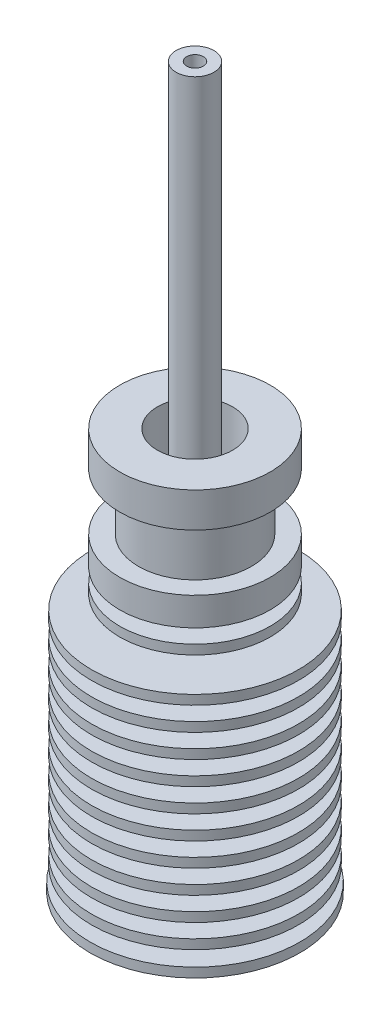
ISO-10303-21;
HEADER;
FILE_DESCRIPTION(('STEP AP214'),'2;1');
FILE_NAME('part.step','',(''),(''),'','','');
FILE_SCHEMA(('AUTOMOTIVE_DESIGN { 1 0 10303 214 1 1 1 1 }'));
ENDSEC;
DATA;
#1=APPLICATION_CONTEXT('core data for automotive mechanical design processes');
#2=APPLICATION_PROTOCOL_DEFINITION('international standard','automotive_design',2000,#1);
#3=PRODUCT_CONTEXT('',#1,'mechanical');
#4=PRODUCT('Part','Part','',(#3));
#5=PRODUCT_RELATED_PRODUCT_CATEGORY('part','',(#4));
#6=PRODUCT_DEFINITION_FORMATION('','',#4);
#7=PRODUCT_DEFINITION_CONTEXT('part definition',#1,'design');
#8=PRODUCT_DEFINITION('design','',#6,#7);
#9=PRODUCT_DEFINITION_SHAPE('','',#8);
#10=(LENGTH_UNIT() NAMED_UNIT(*) SI_UNIT(.MILLI.,.METRE.));
#11=(NAMED_UNIT(*) PLANE_ANGLE_UNIT() SI_UNIT($,.RADIAN.));
#12=(NAMED_UNIT(*) SI_UNIT($,.STERADIAN.) SOLID_ANGLE_UNIT());
#13=UNCERTAINTY_MEASURE_WITH_UNIT(LENGTH_MEASURE(1.E-05),#10,'distance_accuracy_value','');
#14=(GEOMETRIC_REPRESENTATION_CONTEXT(3) GLOBAL_UNCERTAINTY_ASSIGNED_CONTEXT((#13)) GLOBAL_UNIT_ASSIGNED_CONTEXT((#10,
#11,#12)) REPRESENTATION_CONTEXT('',''));
#15=CARTESIAN_POINT('',(0.,0.,0.));
#16=DIRECTION('',(0.,0.,1.));
#17=DIRECTION('',(1.,0.,0.));
#18=AXIS2_PLACEMENT_3D('',#15,#16,#17);
#19=CARTESIAN_POINT('',(0.,0.,0.));
#20=DIRECTION('',(0.,-1.,0.));
#21=DIRECTION('',(0.,0.,-1.));
#22=AXIS2_PLACEMENT_3D('',#19,#20,#21);
#23=CYLINDRICAL_SURFACE('',#22,0.884999999999995);
#24=CARTESIAN_POINT('',(0.,36.,0.));
#25=DIRECTION('',(0.,-1.,0.));
#26=DIRECTION('',(0.,0.,-1.));
#27=AXIS2_PLACEMENT_3D('',#24,#25,#26);
#28=CIRCLE('',#27,0.885);
#29=CARTESIAN_POINT('',(0.,36.,-0.885));
#30=VERTEX_POINT('',#29);
#31=EDGE_CURVE('E70',#30,#30,#28,.T.);
#32=ORIENTED_EDGE('',*,*,#31,.T.);
#33=EDGE_LOOP('',(#32));
#34=FACE_BOUND('',#33,.T.);
#35=CARTESIAN_POINT('',(0.,76.4965756436163,0.));
#36=DIRECTION('',(0.,-1.,0.));
#37=DIRECTION('',(0.,0.,-1.));
#38=AXIS2_PLACEMENT_3D('',#35,#36,#37);
#39=CIRCLE('',#38,0.88499999999999);
#40=CARTESIAN_POINT('',(0.,76.4965756436163,-0.88499999999999));
#41=VERTEX_POINT('',#40);
#42=EDGE_CURVE('E12',#41,#41,#39,.T.);
#43=ORIENTED_EDGE('',*,*,#42,.F.);
#44=EDGE_LOOP('',(#43));
#45=FACE_BOUND('',#44,.T.);
#46=ADVANCED_FACE('F56',(#34,#45),#23,.F.);
#47=CARTESIAN_POINT('',(0.88499999999999,76.4965756436163,0.));
#48=DIRECTION('',(0.,1.,0.));
#49=DIRECTION('',(0.,0.,1.));
#50=AXIS2_PLACEMENT_3D('',#47,#48,#49);
#51=PLANE('',#50);
#52=ORIENTED_EDGE('',*,*,#42,.T.);
#53=EDGE_LOOP('',(#52));
#54=FACE_BOUND('',#53,.T.);
#55=CARTESIAN_POINT('',(0.,76.4965756436163,0.));
#56=DIRECTION('',(0.,-1.,0.));
#57=DIRECTION('',(0.,0.,-1.));
#58=AXIS2_PLACEMENT_3D('',#55,#56,#57);
#59=CIRCLE('',#58,2.005);
#60=CARTESIAN_POINT('',(0.,76.4965756436163,-2.005));
#61=VERTEX_POINT('',#60);
#62=EDGE_CURVE('E62',#61,#61,#59,.T.);
#63=ORIENTED_EDGE('',*,*,#62,.F.);
#64=EDGE_LOOP('',(#63));
#65=FACE_BOUND('',#64,.T.);
#66=ADVANCED_FACE('F86',(#54,#65),#51,.T.);
#67=CARTESIAN_POINT('',(0.,0.,0.));
#68=DIRECTION('',(0.,-1.,0.));
#69=DIRECTION('',(0.,0.,-1.));
#70=AXIS2_PLACEMENT_3D('',#67,#68,#69);
#71=CYLINDRICAL_SURFACE('',#70,2.005);
#72=ORIENTED_EDGE('',*,*,#62,.T.);
#73=EDGE_LOOP('',(#72));
#74=FACE_BOUND('',#73,.T.);
#75=CARTESIAN_POINT('',(0.,36.,0.));
#76=DIRECTION('',(0.,-1.,0.));
#77=DIRECTION('',(0.,0.,-1.));
#78=AXIS2_PLACEMENT_3D('',#75,#76,#77);
#79=CIRCLE('',#78,2.005);
#80=CARTESIAN_POINT('',(0.,36.,-2.005));
#81=VERTEX_POINT('',#80);
#82=EDGE_CURVE('E66',#81,#81,#79,.T.);
#83=ORIENTED_EDGE('',*,*,#82,.F.);
#84=EDGE_LOOP('',(#83));
#85=FACE_BOUND('',#84,.T.);
#86=ADVANCED_FACE('F80',(#74,#85),#71,.T.);
#87=CARTESIAN_POINT('',(0.885,36.,0.));
#88=DIRECTION('',(0.,-1.,0.));
#89=DIRECTION('',(0.,0.,-1.));
#90=AXIS2_PLACEMENT_3D('',#87,#88,#89);
#91=PLANE('',#90);
#92=ORIENTED_EDGE('',*,*,#82,.T.);
#93=EDGE_LOOP('',(#92));
#94=FACE_BOUND('',#93,.T.);
#95=ORIENTED_EDGE('',*,*,#31,.F.);
#96=EDGE_LOOP('',(#95));
#97=FACE_BOUND('',#96,.T.);
#98=ADVANCED_FACE('F78',(#94,#97),#91,.T.);
#99=CLOSED_SHELL('',(#46,#66,#86,#98));
#100=MANIFOLD_SOLID_BREP('B2',#99);
#101=CARTESIAN_POINT('',(0.,0.,0.));
#102=DIRECTION('',(0.,1.,0.));
#103=DIRECTION('',(0.,0.,1.));
#104=AXIS2_PLACEMENT_3D('',#101,#102,#103);
#105=PLANE('',#104);
#106=CARTESIAN_POINT('',(0.,0.,0.));
#107=DIRECTION('',(0.,-1.,0.));
#108=DIRECTION('',(0.,0.,-1.));
#109=AXIS2_PLACEMENT_3D('',#106,#107,#108);
#110=CIRCLE('',#109,3.);
#111=CARTESIAN_POINT('',(0.,0.,-3.));
#112=VERTEX_POINT('',#111);
#113=EDGE_CURVE('E302',#112,#112,#110,.T.);
#114=ORIENTED_EDGE('',*,*,#113,.F.);
#115=EDGE_LOOP('',(#114));
#116=FACE_BOUND('',#115,.T.);
#117=CARTESIAN_POINT('',(0.,0.,0.));
#118=DIRECTION('',(0.,1.,0.));
#119=DIRECTION('',(0.,0.,1.));
#120=AXIS2_PLACEMENT_3D('',#117,#118,#119);
#121=CIRCLE('',#120,11.15);
#122=CARTESIAN_POINT('',(0.,0.,11.15));
#123=VERTEX_POINT('',#122);
#124=EDGE_CURVE('E170',#123,#123,#121,.T.);
#125=ORIENTED_EDGE('',*,*,#124,.F.);
#126=EDGE_LOOP('',(#125));
#127=FACE_BOUND('',#126,.T.);
#128=ADVANCED_FACE('F120',(#116,#127),#105,.F.);
#129=CARTESIAN_POINT('',(0.,42.7,0.));
#130=DIRECTION('',(0.,-1.,0.));
#131=DIRECTION('',(0.,0.,-1.));
#132=AXIS2_PLACEMENT_3D('',#129,#130,#131);
#133=PLANE('',#132);
#134=CARTESIAN_POINT('',(0.,42.7,0.));
#135=DIRECTION('',(0.,1.,0.));
#136=DIRECTION('',(0.,0.,1.));
#137=AXIS2_PLACEMENT_3D('',#134,#135,#136);
#138=CIRCLE('',#137,7.99999999999999);
#139=CARTESIAN_POINT('',(0.,42.7,7.99999999999999));
#140=VERTEX_POINT('',#139);
#141=EDGE_CURVE('E167',#140,#140,#138,.T.);
#142=ORIENTED_EDGE('',*,*,#141,.T.);
#143=EDGE_LOOP('',(#142));
#144=FACE_BOUND('',#143,.T.);
#145=CARTESIAN_POINT('',(0.,42.7,0.));
#146=DIRECTION('',(0.,1.,0.));
#147=DIRECTION('',(0.,0.,1.));
#148=AXIS2_PLACEMENT_3D('',#145,#146,#147);
#149=CIRCLE('',#148,4.);
#150=CARTESIAN_POINT('',(0.,42.7,4.));
#151=VERTEX_POINT('',#150);
#152=EDGE_CURVE('E296',#151,#151,#149,.T.);
#153=ORIENTED_EDGE('',*,*,#152,.F.);
#154=EDGE_LOOP('',(#153));
#155=FACE_BOUND('',#154,.T.);
#156=ADVANCED_FACE('F310',(#144,#155),#133,.F.);
#157=CARTESIAN_POINT('',(0.,0.,0.));
#158=DIRECTION('',(0.,1.,0.));
#159=DIRECTION('',(0.,0.,1.));
#160=AXIS2_PLACEMENT_3D('',#157,#158,#159);
#161=CYLINDRICAL_SURFACE('',#160,11.);
#162=CARTESIAN_POINT('',(0.,22.5,0.));
#163=DIRECTION('',(0.,-1.,0.));
#164=DIRECTION('',(0.,0.,-1.));
#165=AXIS2_PLACEMENT_3D('',#162,#163,#164);
#166=CIRCLE('',#165,11.);
#167=CARTESIAN_POINT('',(0.,22.5,-11.));
#168=VERTEX_POINT('',#167);
#169=EDGE_CURVE('E266',#168,#168,#166,.T.);
#170=ORIENTED_EDGE('',*,*,#169,.F.);
#171=EDGE_LOOP('',(#170));
#172=FACE_BOUND('',#171,.T.);
#173=CARTESIAN_POINT('',(0.,23.5,0.));
#174=DIRECTION('',(0.,-1.,0.));
#175=DIRECTION('',(0.,0.,-1.));
#176=AXIS2_PLACEMENT_3D('',#173,#174,#175);
#177=CIRCLE('',#176,11.);
#178=CARTESIAN_POINT('',(0.,23.5,-11.));
#179=VERTEX_POINT('',#178);
#180=EDGE_CURVE('E287',#179,#179,#177,.T.);
#181=ORIENTED_EDGE('',*,*,#180,.T.);
#182=EDGE_LOOP('',(#181));
#183=FACE_BOUND('',#182,.T.);
#184=ADVANCED_FACE('F377',(#172,#183),#161,.T.);
#185=CARTESIAN_POINT('',(0.,20.,0.));
#186=DIRECTION('',(0.,-1.,0.));
#187=DIRECTION('',(0.,0.,-1.));
#188=AXIS2_PLACEMENT_3D('',#185,#186,#187);
#189=CIRCLE('',#188,11.);
#190=CARTESIAN_POINT('',(0.,20.,-11.));
#191=VERTEX_POINT('',#190);
#192=EDGE_CURVE('E254',#191,#191,#189,.T.);
#193=ORIENTED_EDGE('',*,*,#192,.F.);
#194=EDGE_LOOP('',(#193));
#195=FACE_BOUND('',#194,.T.);
#196=CARTESIAN_POINT('',(0.,21.,0.));
#197=DIRECTION('',(0.,-1.,0.));
#198=DIRECTION('',(0.,0.,-1.));
#199=AXIS2_PLACEMENT_3D('',#196,#197,#198);
#200=CIRCLE('',#199,11.);
#201=CARTESIAN_POINT('',(0.,21.,-11.));
#202=VERTEX_POINT('',#201);
#203=EDGE_CURVE('E275',#202,#202,#200,.T.);
#204=ORIENTED_EDGE('',*,*,#203,.T.);
#205=EDGE_LOOP('',(#204));
#206=FACE_BOUND('',#205,.T.);
#207=ADVANCED_FACE('F441',(#195,#206),#161,.T.);
#208=CARTESIAN_POINT('',(0.,17.5,0.));
#209=DIRECTION('',(0.,-1.,0.));
#210=DIRECTION('',(0.,0.,-1.));
#211=AXIS2_PLACEMENT_3D('',#208,#209,#210);
#212=CIRCLE('',#211,11.);
#213=CARTESIAN_POINT('',(0.,17.5,-11.));
#214=VERTEX_POINT('',#213);
#215=EDGE_CURVE('E242',#214,#214,#212,.T.);
#216=ORIENTED_EDGE('',*,*,#215,.F.);
#217=EDGE_LOOP('',(#216));
#218=FACE_BOUND('',#217,.T.);
#219=CARTESIAN_POINT('',(0.,18.5,0.));
#220=DIRECTION('',(0.,-1.,0.));
#221=DIRECTION('',(0.,0.,-1.));
#222=AXIS2_PLACEMENT_3D('',#219,#220,#221);
#223=CIRCLE('',#222,11.);
#224=CARTESIAN_POINT('',(0.,18.5,-11.));
#225=VERTEX_POINT('',#224);
#226=EDGE_CURVE('E263',#225,#225,#223,.T.);
#227=ORIENTED_EDGE('',*,*,#226,.T.);
#228=EDGE_LOOP('',(#227));
#229=FACE_BOUND('',#228,.T.);
#230=ADVANCED_FACE('F601',(#218,#229),#161,.T.);
#231=CARTESIAN_POINT('',(0.,15.,0.));
#232=DIRECTION('',(0.,-1.,0.));
#233=DIRECTION('',(0.,0.,-1.));
#234=AXIS2_PLACEMENT_3D('',#231,#232,#233);
#235=CIRCLE('',#234,11.);
#236=CARTESIAN_POINT('',(0.,15.,-11.));
#237=VERTEX_POINT('',#236);
#238=EDGE_CURVE('E230',#237,#237,#235,.T.);
#239=ORIENTED_EDGE('',*,*,#238,.F.);
#240=EDGE_LOOP('',(#239));
#241=FACE_BOUND('',#240,.T.);
#242=CARTESIAN_POINT('',(0.,16.,0.));
#243=DIRECTION('',(0.,-1.,0.));
#244=DIRECTION('',(0.,0.,-1.));
#245=AXIS2_PLACEMENT_3D('',#242,#243,#244);
#246=CIRCLE('',#245,11.);
#247=CARTESIAN_POINT('',(0.,16.,-11.));
#248=VERTEX_POINT('',#247);
#249=EDGE_CURVE('E251',#248,#248,#246,.T.);
#250=ORIENTED_EDGE('',*,*,#249,.T.);
#251=EDGE_LOOP('',(#250));
#252=FACE_BOUND('',#251,.T.);
#253=ADVANCED_FACE('F470',(#241,#252),#161,.T.);
#254=CARTESIAN_POINT('',(0.,12.5,0.));
#255=DIRECTION('',(0.,-1.,0.));
#256=DIRECTION('',(0.,0.,-1.));
#257=AXIS2_PLACEMENT_3D('',#254,#255,#256);
#258=CIRCLE('',#257,11.);
#259=CARTESIAN_POINT('',(0.,12.5,-11.));
#260=VERTEX_POINT('',#259);
#261=EDGE_CURVE('E218',#260,#260,#258,.T.);
#262=ORIENTED_EDGE('',*,*,#261,.F.);
#263=EDGE_LOOP('',(#262));
#264=FACE_BOUND('',#263,.T.);
#265=CARTESIAN_POINT('',(0.,13.5,0.));
#266=DIRECTION('',(0.,-1.,0.));
#267=DIRECTION('',(0.,0.,-1.));
#268=AXIS2_PLACEMENT_3D('',#265,#266,#267);
#269=CIRCLE('',#268,11.);
#270=CARTESIAN_POINT('',(0.,13.5,-11.));
#271=VERTEX_POINT('',#270);
#272=EDGE_CURVE('E239',#271,#271,#269,.T.);
#273=ORIENTED_EDGE('',*,*,#272,.T.);
#274=EDGE_LOOP('',(#273));
#275=FACE_BOUND('',#274,.T.);
#276=ADVANCED_FACE('F465',(#264,#275),#161,.T.);
#277=CARTESIAN_POINT('',(0.,10.,0.));
#278=DIRECTION('',(0.,-1.,0.));
#279=DIRECTION('',(0.,0.,-1.));
#280=AXIS2_PLACEMENT_3D('',#277,#278,#279);
#281=CIRCLE('',#280,11.);
#282=CARTESIAN_POINT('',(0.,10.,-11.));
#283=VERTEX_POINT('',#282);
#284=EDGE_CURVE('E206',#283,#283,#281,.T.);
#285=ORIENTED_EDGE('',*,*,#284,.F.);
#286=EDGE_LOOP('',(#285));
#287=FACE_BOUND('',#286,.T.);
#288=CARTESIAN_POINT('',(0.,11.,0.));
#289=DIRECTION('',(0.,-1.,0.));
#290=DIRECTION('',(0.,0.,-1.));
#291=AXIS2_PLACEMENT_3D('',#288,#289,#290);
#292=CIRCLE('',#291,11.);
#293=CARTESIAN_POINT('',(0.,11.,-11.));
#294=VERTEX_POINT('',#293);
#295=EDGE_CURVE('E227',#294,#294,#292,.T.);
#296=ORIENTED_EDGE('',*,*,#295,.T.);
#297=EDGE_LOOP('',(#296));
#298=FACE_BOUND('',#297,.T.);
#299=ADVANCED_FACE('F339',(#287,#298),#161,.T.);
#300=CARTESIAN_POINT('',(0.,10.,0.));
#301=DIRECTION('',(0.,-1.,0.));
#302=DIRECTION('',(0.,0.,-1.));
#303=AXIS2_PLACEMENT_3D('',#300,#301,#302);
#304=PLANE('',#303);
#305=ORIENTED_EDGE('',*,*,#284,.T.);
#306=EDGE_LOOP('',(#305));
#307=FACE_BOUND('',#306,.T.);
#308=CARTESIAN_POINT('',(0.,10.,0.));
#309=DIRECTION('',(0.,-1.,0.));
#310=DIRECTION('',(0.,0.,-1.));
#311=AXIS2_PLACEMENT_3D('',#308,#309,#310);
#312=CIRCLE('',#311,6.);
#313=CARTESIAN_POINT('',(0.,10.,-6.));
#314=VERTEX_POINT('',#313);
#315=EDGE_CURVE('E209',#314,#314,#312,.T.);
#316=ORIENTED_EDGE('',*,*,#315,.F.);
#317=EDGE_LOOP('',(#316));
#318=FACE_BOUND('',#317,.T.);
#319=ADVANCED_FACE('F329',(#307,#318),#304,.T.);
#320=CARTESIAN_POINT('',(0.,7.5,0.));
#321=DIRECTION('',(0.,-1.,0.));
#322=DIRECTION('',(0.,0.,-1.));
#323=AXIS2_PLACEMENT_3D('',#320,#321,#322);
#324=CYLINDRICAL_SURFACE('',#323,6.);
#325=ORIENTED_EDGE('',*,*,#315,.T.);
#326=EDGE_LOOP('',(#325));
#327=FACE_BOUND('',#326,.T.);
#328=CARTESIAN_POINT('',(0.,8.5,0.));
#329=DIRECTION('',(0.,-1.,0.));
#330=DIRECTION('',(0.,0.,-1.));
#331=AXIS2_PLACEMENT_3D('',#328,#329,#330);
#332=CIRCLE('',#331,6.);
#333=CARTESIAN_POINT('',(0.,8.5,-6.));
#334=VERTEX_POINT('',#333);
#335=EDGE_CURVE('E212',#334,#334,#332,.T.);
#336=ORIENTED_EDGE('',*,*,#335,.F.);
#337=EDGE_LOOP('',(#336));
#338=FACE_BOUND('',#337,.T.);
#339=ADVANCED_FACE('F323',(#327,#338),#324,.T.);
#340=CARTESIAN_POINT('',(0.,8.5,0.));
#341=DIRECTION('',(0.,1.,0.));
#342=DIRECTION('',(0.,0.,1.));
#343=AXIS2_PLACEMENT_3D('',#340,#341,#342);
#344=PLANE('',#343);
#345=ORIENTED_EDGE('',*,*,#335,.T.);
#346=EDGE_LOOP('',(#345));
#347=FACE_BOUND('',#346,.T.);
#348=CARTESIAN_POINT('',(0.,8.5,0.));
#349=DIRECTION('',(0.,-1.,0.));
#350=DIRECTION('',(0.,0.,-1.));
#351=AXIS2_PLACEMENT_3D('',#348,#349,#350);
#352=CIRCLE('',#351,11.);
#353=CARTESIAN_POINT('',(0.,8.5,-11.));
#354=VERTEX_POINT('',#353);
#355=EDGE_CURVE('E215',#354,#354,#352,.T.);
#356=ORIENTED_EDGE('',*,*,#355,.F.);
#357=EDGE_LOOP('',(#356));
#358=FACE_BOUND('',#357,.T.);
#359=ADVANCED_FACE('F316',(#347,#358),#344,.T.);
#360=CARTESIAN_POINT('',(0.,0.,0.));
#361=DIRECTION('',(0.,1.,0.));
#362=DIRECTION('',(0.,0.,1.));
#363=AXIS2_PLACEMENT_3D('',#360,#361,#362);
#364=CYLINDRICAL_SURFACE('',#363,11.15);
#365=CARTESIAN_POINT('',(0.,1.,0.));
#366=DIRECTION('',(0.,1.,0.));
#367=DIRECTION('',(0.,0.,1.));
#368=AXIS2_PLACEMENT_3D('',#365,#366,#367);
#369=CIRCLE('',#368,11.15);
#370=CARTESIAN_POINT('',(0.,1.,11.15));
#371=VERTEX_POINT('',#370);
#372=EDGE_CURVE('E55',#371,#371,#369,.T.);
#373=ORIENTED_EDGE('',*,*,#372,.F.);
#374=EDGE_LOOP('',(#373));
#375=FACE_BOUND('',#374,.T.);
#376=ORIENTED_EDGE('',*,*,#124,.T.);
#377=EDGE_LOOP('',(#376));
#378=FACE_BOUND('',#377,.T.);
#379=ADVANCED_FACE('F122',(#375,#378),#364,.T.);
#380=CARTESIAN_POINT('',(0.,1.,0.));
#381=DIRECTION('',(0.,-1.,0.));
#382=DIRECTION('',(0.,0.,-1.));
#383=AXIS2_PLACEMENT_3D('',#380,#381,#382);
#384=PLANE('',#383);
#385=ORIENTED_EDGE('',*,*,#372,.T.);
#386=EDGE_LOOP('',(#385));
#387=FACE_BOUND('',#386,.T.);
#388=CARTESIAN_POINT('',(0.,0.999999999999999,0.));
#389=DIRECTION('',(0.,-1.,0.));
#390=DIRECTION('',(0.,0.,-1.));
#391=AXIS2_PLACEMENT_3D('',#388,#389,#390);
#392=CIRCLE('',#391,6.);
#393=CARTESIAN_POINT('',(0.,0.999999999999999,-6.));
#394=VERTEX_POINT('',#393);
#395=EDGE_CURVE('E179',#394,#394,#392,.T.);
#396=ORIENTED_EDGE('',*,*,#395,.T.);
#397=EDGE_LOOP('',(#396));
#398=FACE_BOUND('',#397,.T.);
#399=ADVANCED_FACE('F315',(#387,#398),#384,.F.);
#400=CARTESIAN_POINT('',(0.,0.,0.));
#401=DIRECTION('',(0.,-1.,0.));
#402=DIRECTION('',(0.,0.,-1.));
#403=AXIS2_PLACEMENT_3D('',#400,#401,#402);
#404=CYLINDRICAL_SURFACE('',#403,6.);
#405=CARTESIAN_POINT('',(0.,2.5,0.));
#406=DIRECTION('',(0.,-1.,0.));
#407=DIRECTION('',(0.,0.,-1.));
#408=AXIS2_PLACEMENT_3D('',#405,#406,#407);
#409=CIRCLE('',#408,6.);
#410=CARTESIAN_POINT('',(0.,2.5,-6.));
#411=VERTEX_POINT('',#410);
#412=EDGE_CURVE('E176',#411,#411,#409,.T.);
#413=ORIENTED_EDGE('',*,*,#412,.T.);
#414=EDGE_LOOP('',(#413));
#415=FACE_BOUND('',#414,.T.);
#416=ORIENTED_EDGE('',*,*,#395,.F.);
#417=EDGE_LOOP('',(#416));
#418=FACE_BOUND('',#417,.T.);
#419=ADVANCED_FACE('F322',(#415,#418),#404,.T.);
#420=CARTESIAN_POINT('',(0.,2.5,0.));
#421=DIRECTION('',(0.,-1.,0.));
#422=DIRECTION('',(0.,0.,-1.));
#423=AXIS2_PLACEMENT_3D('',#420,#421,#422);
#424=PLANE('',#423);
#425=CARTESIAN_POINT('',(0.,2.5,0.));
#426=DIRECTION('',(0.,-1.,0.));
#427=DIRECTION('',(0.,0.,-1.));
#428=AXIS2_PLACEMENT_3D('',#425,#426,#427);
#429=CIRCLE('',#428,11.);
#430=CARTESIAN_POINT('',(0.,2.5,-11.));
#431=VERTEX_POINT('',#430);
#432=EDGE_CURVE('E173',#431,#431,#429,.T.);
#433=ORIENTED_EDGE('',*,*,#432,.T.);
#434=EDGE_LOOP('',(#433));
#435=FACE_BOUND('',#434,.T.);
#436=ORIENTED_EDGE('',*,*,#412,.F.);
#437=EDGE_LOOP('',(#436));
#438=FACE_BOUND('',#437,.T.);
#439=ADVANCED_FACE('F370',(#435,#438),#424,.T.);
#440=ORIENTED_EDGE('',*,*,#432,.F.);
#441=EDGE_LOOP('',(#440));
#442=FACE_BOUND('',#441,.T.);
#443=CARTESIAN_POINT('',(0.,3.5,0.));
#444=DIRECTION('',(0.,-1.,0.));
#445=DIRECTION('',(0.,0.,-1.));
#446=AXIS2_PLACEMENT_3D('',#443,#444,#445);
#447=CIRCLE('',#446,11.);
#448=CARTESIAN_POINT('',(0.,3.5,-11.));
#449=VERTEX_POINT('',#448);
#450=EDGE_CURVE('E191',#449,#449,#447,.T.);
#451=ORIENTED_EDGE('',*,*,#450,.T.);
#452=EDGE_LOOP('',(#451));
#453=FACE_BOUND('',#452,.T.);
#454=ADVANCED_FACE('F359',(#442,#453),#161,.T.);
#455=CARTESIAN_POINT('',(0.,3.5,0.));
#456=DIRECTION('',(0.,1.,0.));
#457=DIRECTION('',(0.,0.,1.));
#458=AXIS2_PLACEMENT_3D('',#455,#456,#457);
#459=PLANE('',#458);
#460=CARTESIAN_POINT('',(0.,3.5,0.));
#461=DIRECTION('',(0.,-1.,0.));
#462=DIRECTION('',(0.,0.,-1.));
#463=AXIS2_PLACEMENT_3D('',#460,#461,#462);
#464=CIRCLE('',#463,6.);
#465=CARTESIAN_POINT('',(0.,3.5,-6.));
#466=VERTEX_POINT('',#465);
#467=EDGE_CURVE('E188',#466,#466,#464,.T.);
#468=ORIENTED_EDGE('',*,*,#467,.T.);
#469=EDGE_LOOP('',(#468));
#470=FACE_BOUND('',#469,.T.);
#471=ORIENTED_EDGE('',*,*,#450,.F.);
#472=EDGE_LOOP('',(#471));
#473=FACE_BOUND('',#472,.T.);
#474=ADVANCED_FACE('F355',(#470,#473),#459,.T.);
#475=CARTESIAN_POINT('',(0.,2.5,0.));
#476=DIRECTION('',(0.,-1.,0.));
#477=DIRECTION('',(0.,0.,-1.));
#478=AXIS2_PLACEMENT_3D('',#475,#476,#477);
#479=CYLINDRICAL_SURFACE('',#478,6.);
#480=CARTESIAN_POINT('',(0.,5.,0.));
#481=DIRECTION('',(0.,-1.,0.));
#482=DIRECTION('',(0.,0.,-1.));
#483=AXIS2_PLACEMENT_3D('',#480,#481,#482);
#484=CIRCLE('',#483,6.);
#485=CARTESIAN_POINT('',(0.,5.,-6.));
#486=VERTEX_POINT('',#485);
#487=EDGE_CURVE('E185',#486,#486,#484,.T.);
#488=ORIENTED_EDGE('',*,*,#487,.T.);
#489=EDGE_LOOP('',(#488));
#490=FACE_BOUND('',#489,.T.);
#491=ORIENTED_EDGE('',*,*,#467,.F.);
#492=EDGE_LOOP('',(#491));
#493=FACE_BOUND('',#492,.T.);
#494=ADVANCED_FACE('F358',(#490,#493),#479,.T.);
#495=CARTESIAN_POINT('',(0.,5.,0.));
#496=DIRECTION('',(0.,-1.,0.));
#497=DIRECTION('',(0.,0.,-1.));
#498=AXIS2_PLACEMENT_3D('',#495,#496,#497);
#499=PLANE('',#498);
#500=CARTESIAN_POINT('',(0.,5.,0.));
#501=DIRECTION('',(0.,-1.,0.));
#502=DIRECTION('',(0.,0.,-1.));
#503=AXIS2_PLACEMENT_3D('',#500,#501,#502);
#504=CIRCLE('',#503,11.);
#505=CARTESIAN_POINT('',(0.,5.,-11.));
#506=VERTEX_POINT('',#505);
#507=EDGE_CURVE('E182',#506,#506,#504,.T.);
#508=ORIENTED_EDGE('',*,*,#507,.T.);
#509=EDGE_LOOP('',(#508));
#510=FACE_BOUND('',#509,.T.);
#511=ORIENTED_EDGE('',*,*,#487,.F.);
#512=EDGE_LOOP('',(#511));
#513=FACE_BOUND('',#512,.T.);
#514=ADVANCED_FACE('F363',(#510,#513),#499,.T.);
#515=ORIENTED_EDGE('',*,*,#507,.F.);
#516=EDGE_LOOP('',(#515));
#517=FACE_BOUND('',#516,.T.);
#518=CARTESIAN_POINT('',(0.,6.,0.));
#519=DIRECTION('',(0.,-1.,0.));
#520=DIRECTION('',(0.,0.,-1.));
#521=AXIS2_PLACEMENT_3D('',#518,#519,#520);
#522=CIRCLE('',#521,11.);
#523=CARTESIAN_POINT('',(0.,6.,-11.));
#524=VERTEX_POINT('',#523);
#525=EDGE_CURVE('E203',#524,#524,#522,.T.);
#526=ORIENTED_EDGE('',*,*,#525,.T.);
#527=EDGE_LOOP('',(#526));
#528=FACE_BOUND('',#527,.T.);
#529=ADVANCED_FACE('F345',(#517,#528),#161,.T.);
#530=CARTESIAN_POINT('',(0.,6.,0.));
#531=DIRECTION('',(0.,1.,0.));
#532=DIRECTION('',(0.,0.,1.));
#533=AXIS2_PLACEMENT_3D('',#530,#531,#532);
#534=PLANE('',#533);
#535=CARTESIAN_POINT('',(0.,6.,0.));
#536=DIRECTION('',(0.,-1.,0.));
#537=DIRECTION('',(0.,0.,-1.));
#538=AXIS2_PLACEMENT_3D('',#535,#536,#537);
#539=CIRCLE('',#538,6.);
#540=CARTESIAN_POINT('',(0.,6.,-6.));
#541=VERTEX_POINT('',#540);
#542=EDGE_CURVE('E200',#541,#541,#539,.T.);
#543=ORIENTED_EDGE('',*,*,#542,.T.);
#544=EDGE_LOOP('',(#543));
#545=FACE_BOUND('',#544,.T.);
#546=ORIENTED_EDGE('',*,*,#525,.F.);
#547=EDGE_LOOP('',(#546));
#548=FACE_BOUND('',#547,.T.);
#549=ADVANCED_FACE('F341',(#545,#548),#534,.T.);
#550=CARTESIAN_POINT('',(0.,5.,0.));
#551=DIRECTION('',(0.,-1.,0.));
#552=DIRECTION('',(0.,0.,-1.));
#553=AXIS2_PLACEMENT_3D('',#550,#551,#552);
#554=CYLINDRICAL_SURFACE('',#553,6.);
#555=CARTESIAN_POINT('',(0.,7.5,0.));
#556=DIRECTION('',(0.,-1.,0.));
#557=DIRECTION('',(0.,0.,-1.));
#558=AXIS2_PLACEMENT_3D('',#555,#556,#557);
#559=CIRCLE('',#558,6.);
#560=CARTESIAN_POINT('',(0.,7.5,-6.));
#561=VERTEX_POINT('',#560);
#562=EDGE_CURVE('E197',#561,#561,#559,.T.);
#563=ORIENTED_EDGE('',*,*,#562,.T.);
#564=EDGE_LOOP('',(#563));
#565=FACE_BOUND('',#564,.T.);
#566=ORIENTED_EDGE('',*,*,#542,.F.);
#567=EDGE_LOOP('',(#566));
#568=FACE_BOUND('',#567,.T.);
#569=ADVANCED_FACE('F344',(#565,#568),#554,.T.);
#570=CARTESIAN_POINT('',(0.,7.5,0.));
#571=DIRECTION('',(0.,-1.,0.));
#572=DIRECTION('',(0.,0.,-1.));
#573=AXIS2_PLACEMENT_3D('',#570,#571,#572);
#574=PLANE('',#573);
#575=CARTESIAN_POINT('',(0.,7.5,0.));
#576=DIRECTION('',(0.,-1.,0.));
#577=DIRECTION('',(0.,0.,-1.));
#578=AXIS2_PLACEMENT_3D('',#575,#576,#577);
#579=CIRCLE('',#578,11.);
#580=CARTESIAN_POINT('',(0.,7.5,-11.));
#581=VERTEX_POINT('',#580);
#582=EDGE_CURVE('E194',#581,#581,#579,.T.);
#583=ORIENTED_EDGE('',*,*,#582,.T.);
#584=EDGE_LOOP('',(#583));
#585=FACE_BOUND('',#584,.T.);
#586=ORIENTED_EDGE('',*,*,#562,.F.);
#587=EDGE_LOOP('',(#586));
#588=FACE_BOUND('',#587,.T.);
#589=ADVANCED_FACE('F349',(#585,#588),#574,.T.);
#590=ORIENTED_EDGE('',*,*,#582,.F.);
#591=EDGE_LOOP('',(#590));
#592=FACE_BOUND('',#591,.T.);
#593=ORIENTED_EDGE('',*,*,#355,.T.);
#594=EDGE_LOOP('',(#593));
#595=FACE_BOUND('',#594,.T.);
#596=ADVANCED_FACE('F353',(#592,#595),#161,.T.);
#597=CARTESIAN_POINT('',(0.,12.5,0.));
#598=DIRECTION('',(0.,-1.,0.));
#599=DIRECTION('',(0.,0.,-1.));
#600=AXIS2_PLACEMENT_3D('',#597,#598,#599);
#601=PLANE('',#600);
#602=ORIENTED_EDGE('',*,*,#261,.T.);
#603=EDGE_LOOP('',(#602));
#604=FACE_BOUND('',#603,.T.);
#605=CARTESIAN_POINT('',(0.,12.5,0.));
#606=DIRECTION('',(0.,-1.,0.));
#607=DIRECTION('',(0.,0.,-1.));
#608=AXIS2_PLACEMENT_3D('',#605,#606,#607);
#609=CIRCLE('',#608,6.);
#610=CARTESIAN_POINT('',(0.,12.5,-6.));
#611=VERTEX_POINT('',#610);
#612=EDGE_CURVE('E221',#611,#611,#609,.T.);
#613=ORIENTED_EDGE('',*,*,#612,.F.);
#614=EDGE_LOOP('',(#613));
#615=FACE_BOUND('',#614,.T.);
#616=ADVANCED_FACE('F334',(#604,#615),#601,.T.);
#617=CARTESIAN_POINT('',(0.,10.,0.));
#618=DIRECTION('',(0.,-1.,0.));
#619=DIRECTION('',(0.,0.,-1.));
#620=AXIS2_PLACEMENT_3D('',#617,#618,#619);
#621=CYLINDRICAL_SURFACE('',#620,6.);
#622=ORIENTED_EDGE('',*,*,#612,.T.);
#623=EDGE_LOOP('',(#622));
#624=FACE_BOUND('',#623,.T.);
#625=CARTESIAN_POINT('',(0.,11.,0.));
#626=DIRECTION('',(0.,-1.,0.));
#627=DIRECTION('',(0.,0.,-1.));
#628=AXIS2_PLACEMENT_3D('',#625,#626,#627);
#629=CIRCLE('',#628,6.);
#630=CARTESIAN_POINT('',(0.,11.,-6.));
#631=VERTEX_POINT('',#630);
#632=EDGE_CURVE('E224',#631,#631,#629,.T.);
#633=ORIENTED_EDGE('',*,*,#632,.F.);
#634=EDGE_LOOP('',(#633));
#635=FACE_BOUND('',#634,.T.);
#636=ADVANCED_FACE('F460',(#624,#635),#621,.T.);
#637=CARTESIAN_POINT('',(0.,11.,0.));
#638=DIRECTION('',(0.,1.,0.));
#639=DIRECTION('',(0.,0.,1.));
#640=AXIS2_PLACEMENT_3D('',#637,#638,#639);
#641=PLANE('',#640);
#642=ORIENTED_EDGE('',*,*,#632,.T.);
#643=EDGE_LOOP('',(#642));
#644=FACE_BOUND('',#643,.T.);
#645=ORIENTED_EDGE('',*,*,#295,.F.);
#646=EDGE_LOOP('',(#645));
#647=FACE_BOUND('',#646,.T.);
#648=ADVANCED_FACE('F476',(#644,#647),#641,.T.);
#649=CARTESIAN_POINT('',(0.,15.,0.));
#650=DIRECTION('',(0.,-1.,0.));
#651=DIRECTION('',(0.,0.,-1.));
#652=AXIS2_PLACEMENT_3D('',#649,#650,#651);
#653=PLANE('',#652);
#654=ORIENTED_EDGE('',*,*,#238,.T.);
#655=EDGE_LOOP('',(#654));
#656=FACE_BOUND('',#655,.T.);
#657=CARTESIAN_POINT('',(0.,15.,0.));
#658=DIRECTION('',(0.,-1.,0.));
#659=DIRECTION('',(0.,0.,-1.));
#660=AXIS2_PLACEMENT_3D('',#657,#658,#659);
#661=CIRCLE('',#660,6.);
#662=CARTESIAN_POINT('',(0.,15.,-6.));
#663=VERTEX_POINT('',#662);
#664=EDGE_CURVE('E233',#663,#663,#661,.T.);
#665=ORIENTED_EDGE('',*,*,#664,.F.);
#666=EDGE_LOOP('',(#665));
#667=FACE_BOUND('',#666,.T.);
#668=ADVANCED_FACE('F478',(#656,#667),#653,.T.);
#669=CARTESIAN_POINT('',(0.,12.5,0.));
#670=DIRECTION('',(0.,-1.,0.));
#671=DIRECTION('',(0.,0.,-1.));
#672=AXIS2_PLACEMENT_3D('',#669,#670,#671);
#673=CYLINDRICAL_SURFACE('',#672,6.);
#674=ORIENTED_EDGE('',*,*,#664,.T.);
#675=EDGE_LOOP('',(#674));
#676=FACE_BOUND('',#675,.T.);
#677=CARTESIAN_POINT('',(0.,13.5,0.));
#678=DIRECTION('',(0.,-1.,0.));
#679=DIRECTION('',(0.,0.,-1.));
#680=AXIS2_PLACEMENT_3D('',#677,#678,#679);
#681=CIRCLE('',#680,6.);
#682=CARTESIAN_POINT('',(0.,13.5,-6.));
#683=VERTEX_POINT('',#682);
#684=EDGE_CURVE('E236',#683,#683,#681,.T.);
#685=ORIENTED_EDGE('',*,*,#684,.F.);
#686=EDGE_LOOP('',(#685));
#687=FACE_BOUND('',#686,.T.);
#688=ADVANCED_FACE('F485',(#676,#687),#673,.T.);
#689=CARTESIAN_POINT('',(0.,13.5,0.));
#690=DIRECTION('',(0.,1.,0.));
#691=DIRECTION('',(0.,0.,1.));
#692=AXIS2_PLACEMENT_3D('',#689,#690,#691);
#693=PLANE('',#692);
#694=ORIENTED_EDGE('',*,*,#684,.T.);
#695=EDGE_LOOP('',(#694));
#696=FACE_BOUND('',#695,.T.);
#697=ORIENTED_EDGE('',*,*,#272,.F.);
#698=EDGE_LOOP('',(#697));
#699=FACE_BOUND('',#698,.T.);
#700=ADVANCED_FACE('F492',(#696,#699),#693,.T.);
#701=CARTESIAN_POINT('',(0.,17.5,0.));
#702=DIRECTION('',(0.,-1.,0.));
#703=DIRECTION('',(0.,0.,-1.));
#704=AXIS2_PLACEMENT_3D('',#701,#702,#703);
#705=PLANE('',#704);
#706=ORIENTED_EDGE('',*,*,#215,.T.);
#707=EDGE_LOOP('',(#706));
#708=FACE_BOUND('',#707,.T.);
#709=CARTESIAN_POINT('',(0.,17.5,0.));
#710=DIRECTION('',(0.,-1.,0.));
#711=DIRECTION('',(0.,0.,-1.));
#712=AXIS2_PLACEMENT_3D('',#709,#710,#711);
#713=CIRCLE('',#712,6.);
#714=CARTESIAN_POINT('',(0.,17.5,-6.));
#715=VERTEX_POINT('',#714);
#716=EDGE_CURVE('E245',#715,#715,#713,.T.);
#717=ORIENTED_EDGE('',*,*,#716,.F.);
#718=EDGE_LOOP('',(#717));
#719=FACE_BOUND('',#718,.T.);
#720=ADVANCED_FACE('F496',(#708,#719),#705,.T.);
#721=CARTESIAN_POINT('',(0.,15.,0.));
#722=DIRECTION('',(0.,-1.,0.));
#723=DIRECTION('',(0.,0.,-1.));
#724=AXIS2_PLACEMENT_3D('',#721,#722,#723);
#725=CYLINDRICAL_SURFACE('',#724,6.);
#726=ORIENTED_EDGE('',*,*,#716,.T.);
#727=EDGE_LOOP('',(#726));
#728=FACE_BOUND('',#727,.T.);
#729=CARTESIAN_POINT('',(0.,16.,0.));
#730=DIRECTION('',(0.,-1.,0.));
#731=DIRECTION('',(0.,0.,-1.));
#732=AXIS2_PLACEMENT_3D('',#729,#730,#731);
#733=CIRCLE('',#732,6.);
#734=CARTESIAN_POINT('',(0.,16.,-6.));
#735=VERTEX_POINT('',#734);
#736=EDGE_CURVE('E248',#735,#735,#733,.T.);
#737=ORIENTED_EDGE('',*,*,#736,.F.);
#738=EDGE_LOOP('',(#737));
#739=FACE_BOUND('',#738,.T.);
#740=ADVANCED_FACE('F500',(#728,#739),#725,.T.);
#741=CARTESIAN_POINT('',(0.,16.,0.));
#742=DIRECTION('',(0.,1.,0.));
#743=DIRECTION('',(0.,0.,1.));
#744=AXIS2_PLACEMENT_3D('',#741,#742,#743);
#745=PLANE('',#744);
#746=ORIENTED_EDGE('',*,*,#736,.T.);
#747=EDGE_LOOP('',(#746));
#748=FACE_BOUND('',#747,.T.);
#749=ORIENTED_EDGE('',*,*,#249,.F.);
#750=EDGE_LOOP('',(#749));
#751=FACE_BOUND('',#750,.T.);
#752=ADVANCED_FACE('F504',(#748,#751),#745,.T.);
#753=CARTESIAN_POINT('',(0.,20.,0.));
#754=DIRECTION('',(0.,-1.,0.));
#755=DIRECTION('',(0.,0.,-1.));
#756=AXIS2_PLACEMENT_3D('',#753,#754,#755);
#757=PLANE('',#756);
#758=ORIENTED_EDGE('',*,*,#192,.T.);
#759=EDGE_LOOP('',(#758));
#760=FACE_BOUND('',#759,.T.);
#761=CARTESIAN_POINT('',(0.,20.,0.));
#762=DIRECTION('',(0.,-1.,0.));
#763=DIRECTION('',(0.,0.,-1.));
#764=AXIS2_PLACEMENT_3D('',#761,#762,#763);
#765=CIRCLE('',#764,6.);
#766=CARTESIAN_POINT('',(0.,20.,-6.));
#767=VERTEX_POINT('',#766);
#768=EDGE_CURVE('E257',#767,#767,#765,.T.);
#769=ORIENTED_EDGE('',*,*,#768,.F.);
#770=EDGE_LOOP('',(#769));
#771=FACE_BOUND('',#770,.T.);
#772=ADVANCED_FACE('F508',(#760,#771),#757,.T.);
#773=CARTESIAN_POINT('',(0.,17.5,0.));
#774=DIRECTION('',(0.,-1.,0.));
#775=DIRECTION('',(0.,0.,-1.));
#776=AXIS2_PLACEMENT_3D('',#773,#774,#775);
#777=CYLINDRICAL_SURFACE('',#776,6.);
#778=ORIENTED_EDGE('',*,*,#768,.T.);
#779=EDGE_LOOP('',(#778));
#780=FACE_BOUND('',#779,.T.);
#781=CARTESIAN_POINT('',(0.,18.5,0.));
#782=DIRECTION('',(0.,-1.,0.));
#783=DIRECTION('',(0.,0.,-1.));
#784=AXIS2_PLACEMENT_3D('',#781,#782,#783);
#785=CIRCLE('',#784,6.);
#786=CARTESIAN_POINT('',(0.,18.5,-6.));
#787=VERTEX_POINT('',#786);
#788=EDGE_CURVE('E260',#787,#787,#785,.T.);
#789=ORIENTED_EDGE('',*,*,#788,.F.);
#790=EDGE_LOOP('',(#789));
#791=FACE_BOUND('',#790,.T.);
#792=ADVANCED_FACE('F512',(#780,#791),#777,.T.);
#793=CARTESIAN_POINT('',(0.,18.5,0.));
#794=DIRECTION('',(0.,1.,0.));
#795=DIRECTION('',(0.,0.,1.));
#796=AXIS2_PLACEMENT_3D('',#793,#794,#795);
#797=PLANE('',#796);
#798=ORIENTED_EDGE('',*,*,#788,.T.);
#799=EDGE_LOOP('',(#798));
#800=FACE_BOUND('',#799,.T.);
#801=ORIENTED_EDGE('',*,*,#226,.F.);
#802=EDGE_LOOP('',(#801));
#803=FACE_BOUND('',#802,.T.);
#804=ADVANCED_FACE('F516',(#800,#803),#797,.T.);
#805=CARTESIAN_POINT('',(0.,22.5,0.));
#806=DIRECTION('',(0.,-1.,0.));
#807=DIRECTION('',(0.,0.,-1.));
#808=AXIS2_PLACEMENT_3D('',#805,#806,#807);
#809=PLANE('',#808);
#810=ORIENTED_EDGE('',*,*,#169,.T.);
#811=EDGE_LOOP('',(#810));
#812=FACE_BOUND('',#811,.T.);
#813=CARTESIAN_POINT('',(0.,22.5,0.));
#814=DIRECTION('',(0.,-1.,0.));
#815=DIRECTION('',(0.,0.,-1.));
#816=AXIS2_PLACEMENT_3D('',#813,#814,#815);
#817=CIRCLE('',#816,6.);
#818=CARTESIAN_POINT('',(0.,22.5,-6.));
#819=VERTEX_POINT('',#818);
#820=EDGE_CURVE('E269',#819,#819,#817,.T.);
#821=ORIENTED_EDGE('',*,*,#820,.F.);
#822=EDGE_LOOP('',(#821));
#823=FACE_BOUND('',#822,.T.);
#824=ADVANCED_FACE('F520',(#812,#823),#809,.T.);
#825=CARTESIAN_POINT('',(0.,20.,0.));
#826=DIRECTION('',(0.,-1.,0.));
#827=DIRECTION('',(0.,0.,-1.));
#828=AXIS2_PLACEMENT_3D('',#825,#826,#827);
#829=CYLINDRICAL_SURFACE('',#828,6.);
#830=ORIENTED_EDGE('',*,*,#820,.T.);
#831=EDGE_LOOP('',(#830));
#832=FACE_BOUND('',#831,.T.);
#833=CARTESIAN_POINT('',(0.,21.,0.));
#834=DIRECTION('',(0.,-1.,0.));
#835=DIRECTION('',(0.,0.,-1.));
#836=AXIS2_PLACEMENT_3D('',#833,#834,#835);
#837=CIRCLE('',#836,6.);
#838=CARTESIAN_POINT('',(0.,21.,-6.));
#839=VERTEX_POINT('',#838);
#840=EDGE_CURVE('E272',#839,#839,#837,.T.);
#841=ORIENTED_EDGE('',*,*,#840,.F.);
#842=EDGE_LOOP('',(#841));
#843=FACE_BOUND('',#842,.T.);
#844=ADVANCED_FACE('F524',(#832,#843),#829,.T.);
#845=CARTESIAN_POINT('',(0.,21.,0.));
#846=DIRECTION('',(0.,1.,0.));
#847=DIRECTION('',(0.,0.,1.));
#848=AXIS2_PLACEMENT_3D('',#845,#846,#847);
#849=PLANE('',#848);
#850=ORIENTED_EDGE('',*,*,#840,.T.);
#851=EDGE_LOOP('',(#850));
#852=FACE_BOUND('',#851,.T.);
#853=ORIENTED_EDGE('',*,*,#203,.F.);
#854=EDGE_LOOP('',(#853));
#855=FACE_BOUND('',#854,.T.);
#856=ADVANCED_FACE('F528',(#852,#855),#849,.T.);
#857=CARTESIAN_POINT('',(0.,25.,0.));
#858=DIRECTION('',(0.,-1.,0.));
#859=DIRECTION('',(0.,0.,-1.));
#860=AXIS2_PLACEMENT_3D('',#857,#858,#859);
#861=PLANE('',#860);
#862=CARTESIAN_POINT('',(0.,25.,0.));
#863=DIRECTION('',(0.,-1.,0.));
#864=DIRECTION('',(0.,0.,-1.));
#865=AXIS2_PLACEMENT_3D('',#862,#863,#864);
#866=CIRCLE('',#865,11.);
#867=CARTESIAN_POINT('',(0.,25.,-11.));
#868=VERTEX_POINT('',#867);
#869=EDGE_CURVE('E278',#868,#868,#866,.T.);
#870=ORIENTED_EDGE('',*,*,#869,.T.);
#871=EDGE_LOOP('',(#870));
#872=FACE_BOUND('',#871,.T.);
#873=CARTESIAN_POINT('',(0.,25.,0.));
#874=DIRECTION('',(0.,-1.,0.));
#875=DIRECTION('',(0.,0.,-1.));
#876=AXIS2_PLACEMENT_3D('',#873,#874,#875);
#877=CIRCLE('',#876,6.);
#878=CARTESIAN_POINT('',(0.,25.,-6.));
#879=VERTEX_POINT('',#878);
#880=EDGE_CURVE('E281',#879,#879,#877,.T.);
#881=ORIENTED_EDGE('',*,*,#880,.F.);
#882=EDGE_LOOP('',(#881));
#883=FACE_BOUND('',#882,.T.);
#884=ADVANCED_FACE('F532',(#872,#883),#861,.T.);
#885=CARTESIAN_POINT('',(0.,22.5,0.));
#886=DIRECTION('',(0.,-1.,0.));
#887=DIRECTION('',(0.,0.,-1.));
#888=AXIS2_PLACEMENT_3D('',#885,#886,#887);
#889=CYLINDRICAL_SURFACE('',#888,6.);
#890=ORIENTED_EDGE('',*,*,#880,.T.);
#891=EDGE_LOOP('',(#890));
#892=FACE_BOUND('',#891,.T.);
#893=CARTESIAN_POINT('',(0.,23.5,0.));
#894=DIRECTION('',(0.,-1.,0.));
#895=DIRECTION('',(0.,0.,-1.));
#896=AXIS2_PLACEMENT_3D('',#893,#894,#895);
#897=CIRCLE('',#896,6.);
#898=CARTESIAN_POINT('',(0.,23.5,-6.));
#899=VERTEX_POINT('',#898);
#900=EDGE_CURVE('E284',#899,#899,#897,.T.);
#901=ORIENTED_EDGE('',*,*,#900,.F.);
#902=EDGE_LOOP('',(#901));
#903=FACE_BOUND('',#902,.T.);
#904=ADVANCED_FACE('F536',(#892,#903),#889,.T.);
#905=CARTESIAN_POINT('',(0.,23.5,0.));
#906=DIRECTION('',(0.,1.,0.));
#907=DIRECTION('',(0.,0.,1.));
#908=AXIS2_PLACEMENT_3D('',#905,#906,#907);
#909=PLANE('',#908);
#910=ORIENTED_EDGE('',*,*,#900,.T.);
#911=EDGE_LOOP('',(#910));
#912=FACE_BOUND('',#911,.T.);
#913=ORIENTED_EDGE('',*,*,#180,.F.);
#914=EDGE_LOOP('',(#913));
#915=FACE_BOUND('',#914,.T.);
#916=ADVANCED_FACE('F383',(#912,#915),#909,.T.);
#917=CARTESIAN_POINT('',(0.,0.,0.));
#918=DIRECTION('',(0.,1.,0.));
#919=DIRECTION('',(0.,0.,1.));
#920=AXIS2_PLACEMENT_3D('',#917,#918,#919);
#921=CYLINDRICAL_SURFACE('',#920,7.99999999999999);
#922=ORIENTED_EDGE('',*,*,#141,.F.);
#923=EDGE_LOOP('',(#922));
#924=FACE_BOUND('',#923,.T.);
#925=CARTESIAN_POINT('',(0.,39.,0.));
#926=DIRECTION('',(0.,1.,0.));
#927=DIRECTION('',(0.,0.,1.));
#928=AXIS2_PLACEMENT_3D('',#925,#926,#927);
#929=CIRCLE('',#928,7.99999999999999);
#930=CARTESIAN_POINT('',(0.,39.,7.99999999999999));
#931=VERTEX_POINT('',#930);
#932=EDGE_CURVE('E164',#931,#931,#929,.T.);
#933=ORIENTED_EDGE('',*,*,#932,.T.);
#934=EDGE_LOOP('',(#933));
#935=FACE_BOUND('',#934,.T.);
#936=ADVANCED_FACE('F379',(#924,#935),#921,.T.);
#937=CARTESIAN_POINT('',(0.,39.,0.));
#938=DIRECTION('',(0.,1.,0.));
#939=DIRECTION('',(0.,0.,1.));
#940=AXIS2_PLACEMENT_3D('',#937,#938,#939);
#941=PLANE('',#940);
#942=ORIENTED_EDGE('',*,*,#932,.F.);
#943=EDGE_LOOP('',(#942));
#944=FACE_BOUND('',#943,.T.);
#945=CARTESIAN_POINT('',(0.,39.,0.));
#946=DIRECTION('',(0.,1.,0.));
#947=DIRECTION('',(0.,0.,1.));
#948=AXIS2_PLACEMENT_3D('',#945,#946,#947);
#949=CIRCLE('',#948,5.99999999999999);
#950=CARTESIAN_POINT('',(0.,39.,5.99999999999999));
#951=VERTEX_POINT('',#950);
#952=EDGE_CURVE('E161',#951,#951,#949,.T.);
#953=ORIENTED_EDGE('',*,*,#952,.T.);
#954=EDGE_LOOP('',(#953));
#955=FACE_BOUND('',#954,.T.);
#956=ADVANCED_FACE('F382',(#944,#955),#941,.F.);
#957=CARTESIAN_POINT('',(0.,0.,0.));
#958=DIRECTION('',(0.,1.,0.));
#959=DIRECTION('',(0.,0.,1.));
#960=AXIS2_PLACEMENT_3D('',#957,#958,#959);
#961=CYLINDRICAL_SURFACE('',#960,5.99999999999999);
#962=ORIENTED_EDGE('',*,*,#952,.F.);
#963=EDGE_LOOP('',(#962));
#964=FACE_BOUND('',#963,.T.);
#965=CARTESIAN_POINT('',(0.,33.,0.));
#966=DIRECTION('',(0.,1.,0.));
#967=DIRECTION('',(0.,0.,1.));
#968=AXIS2_PLACEMENT_3D('',#965,#966,#967);
#969=CIRCLE('',#968,5.99999999999999);
#970=CARTESIAN_POINT('',(0.,33.,5.99999999999999));
#971=VERTEX_POINT('',#970);
#972=EDGE_CURVE('E158',#971,#971,#969,.T.);
#973=ORIENTED_EDGE('',*,*,#972,.T.);
#974=EDGE_LOOP('',(#973));
#975=FACE_BOUND('',#974,.T.);
#976=ADVANCED_FACE('F387',(#964,#975),#961,.T.);
#977=CARTESIAN_POINT('',(0.,33.,0.));
#978=DIRECTION('',(0.,-1.,0.));
#979=DIRECTION('',(0.,0.,-1.));
#980=AXIS2_PLACEMENT_3D('',#977,#978,#979);
#981=PLANE('',#980);
#982=ORIENTED_EDGE('',*,*,#972,.F.);
#983=EDGE_LOOP('',(#982));
#984=FACE_BOUND('',#983,.T.);
#985=CARTESIAN_POINT('',(0.,33.,0.));
#986=DIRECTION('',(0.,1.,0.));
#987=DIRECTION('',(0.,0.,1.));
#988=AXIS2_PLACEMENT_3D('',#985,#986,#987);
#989=CIRCLE('',#988,7.99999999999999);
#990=CARTESIAN_POINT('',(0.,33.,7.99999999999999));
#991=VERTEX_POINT('',#990);
#992=EDGE_CURVE('E155',#991,#991,#989,.T.);
#993=ORIENTED_EDGE('',*,*,#992,.T.);
#994=EDGE_LOOP('',(#993));
#995=FACE_BOUND('',#994,.T.);
#996=ADVANCED_FACE('F391',(#984,#995),#981,.F.);
#997=CARTESIAN_POINT('',(0.,0.,0.));
#998=DIRECTION('',(0.,1.,0.));
#999=DIRECTION('',(0.,0.,1.));
#1000=AXIS2_PLACEMENT_3D('',#997,#998,#999);
#1001=CYLINDRICAL_SURFACE('',#1000,7.99999999999999);
#1002=ORIENTED_EDGE('',*,*,#992,.F.);
#1003=EDGE_LOOP('',(#1002));
#1004=FACE_BOUND('',#1003,.T.);
#1005=CARTESIAN_POINT('',(0.,30.,0.));
#1006=DIRECTION('',(0.,1.,0.));
#1007=DIRECTION('',(0.,0.,1.));
#1008=AXIS2_PLACEMENT_3D('',#1005,#1006,#1007);
#1009=CIRCLE('',#1008,7.99999999999999);
#1010=CARTESIAN_POINT('',(0.,30.,7.99999999999999));
#1011=VERTEX_POINT('',#1010);
#1012=EDGE_CURVE('E152',#1011,#1011,#1009,.T.);
#1013=ORIENTED_EDGE('',*,*,#1012,.T.);
#1014=EDGE_LOOP('',(#1013));
#1015=FACE_BOUND('',#1014,.T.);
#1016=ADVANCED_FACE('F395',(#1004,#1015),#1001,.T.);
#1017=CARTESIAN_POINT('',(0.,30.,0.));
#1018=DIRECTION('',(0.,-1.,0.));
#1019=DIRECTION('',(0.,0.,-1.));
#1020=AXIS2_PLACEMENT_3D('',#1017,#1018,#1019);
#1021=PLANE('',#1020);
#1022=CARTESIAN_POINT('',(0.,30.,0.));
#1023=DIRECTION('',(0.,1.,0.));
#1024=DIRECTION('',(0.,0.,1.));
#1025=AXIS2_PLACEMENT_3D('',#1022,#1023,#1024);
#1026=CIRCLE('',#1025,3.5);
#1027=CARTESIAN_POINT('',(0.,30.,3.5));
#1028=VERTEX_POINT('',#1027);
#1029=EDGE_CURVE('E149',#1028,#1028,#1026,.T.);
#1030=ORIENTED_EDGE('',*,*,#1029,.T.);
#1031=EDGE_LOOP('',(#1030));
#1032=FACE_BOUND('',#1031,.T.);
#1033=ORIENTED_EDGE('',*,*,#1012,.F.);
#1034=EDGE_LOOP('',(#1033));
#1035=FACE_BOUND('',#1034,.T.);
#1036=ADVANCED_FACE('F399',(#1032,#1035),#1021,.T.);
#1037=CARTESIAN_POINT('',(0.,0.,0.));
#1038=DIRECTION('',(0.,1.,0.));
#1039=DIRECTION('',(0.,0.,1.));
#1040=AXIS2_PLACEMENT_3D('',#1037,#1038,#1039);
#1041=CYLINDRICAL_SURFACE('',#1040,3.5);
#1042=ORIENTED_EDGE('',*,*,#1029,.F.);
#1043=EDGE_LOOP('',(#1042));
#1044=FACE_BOUND('',#1043,.T.);
#1045=CARTESIAN_POINT('',(0.,28.5,0.));
#1046=DIRECTION('',(0.,1.,0.));
#1047=DIRECTION('',(0.,0.,1.));
#1048=AXIS2_PLACEMENT_3D('',#1045,#1046,#1047);
#1049=CIRCLE('',#1048,3.5);
#1050=CARTESIAN_POINT('',(0.,28.5,3.5));
#1051=VERTEX_POINT('',#1050);
#1052=EDGE_CURVE('E146',#1051,#1051,#1049,.T.);
#1053=ORIENTED_EDGE('',*,*,#1052,.T.);
#1054=EDGE_LOOP('',(#1053));
#1055=FACE_BOUND('',#1054,.T.);
#1056=ADVANCED_FACE('F403',(#1044,#1055),#1041,.T.);
#1057=CARTESIAN_POINT('',(0.,28.5,0.));
#1058=DIRECTION('',(0.,-1.,0.));
#1059=DIRECTION('',(0.,0.,-1.));
#1060=AXIS2_PLACEMENT_3D('',#1057,#1058,#1059);
#1061=PLANE('',#1060);
#1062=ORIENTED_EDGE('',*,*,#1052,.F.);
#1063=EDGE_LOOP('',(#1062));
#1064=FACE_BOUND('',#1063,.T.);
#1065=CARTESIAN_POINT('',(0.,28.5,0.));
#1066=DIRECTION('',(0.,1.,0.));
#1067=DIRECTION('',(0.,0.,1.));
#1068=AXIS2_PLACEMENT_3D('',#1065,#1066,#1067);
#1069=CIRCLE('',#1068,8.);
#1070=CARTESIAN_POINT('',(0.,28.5,8.));
#1071=VERTEX_POINT('',#1070);
#1072=EDGE_CURVE('E143',#1071,#1071,#1069,.T.);
#1073=ORIENTED_EDGE('',*,*,#1072,.T.);
#1074=EDGE_LOOP('',(#1073));
#1075=FACE_BOUND('',#1074,.T.);
#1076=ADVANCED_FACE('F407',(#1064,#1075),#1061,.F.);
#1077=CARTESIAN_POINT('',(0.,0.,0.));
#1078=DIRECTION('',(0.,1.,0.));
#1079=DIRECTION('',(0.,0.,1.));
#1080=AXIS2_PLACEMENT_3D('',#1077,#1078,#1079);
#1081=CYLINDRICAL_SURFACE('',#1080,8.);
#1082=ORIENTED_EDGE('',*,*,#1072,.F.);
#1083=EDGE_LOOP('',(#1082));
#1084=FACE_BOUND('',#1083,.T.);
#1085=CARTESIAN_POINT('',(0.,27.5,0.));
#1086=DIRECTION('',(0.,1.,0.));
#1087=DIRECTION('',(0.,0.,1.));
#1088=AXIS2_PLACEMENT_3D('',#1085,#1086,#1087);
#1089=CIRCLE('',#1088,8.);
#1090=CARTESIAN_POINT('',(0.,27.5,8.));
#1091=VERTEX_POINT('',#1090);
#1092=EDGE_CURVE('E140',#1091,#1091,#1089,.T.);
#1093=ORIENTED_EDGE('',*,*,#1092,.T.);
#1094=EDGE_LOOP('',(#1093));
#1095=FACE_BOUND('',#1094,.T.);
#1096=ADVANCED_FACE('F411',(#1084,#1095),#1081,.T.);
#1097=CARTESIAN_POINT('',(0.,27.5,0.));
#1098=DIRECTION('',(0.,1.,0.));
#1099=DIRECTION('',(0.,0.,1.));
#1100=AXIS2_PLACEMENT_3D('',#1097,#1098,#1099);
#1101=PLANE('',#1100);
#1102=ORIENTED_EDGE('',*,*,#1092,.F.);
#1103=EDGE_LOOP('',(#1102));
#1104=FACE_BOUND('',#1103,.T.);
#1105=CARTESIAN_POINT('',(0.,27.5,0.));
#1106=DIRECTION('',(0.,1.,0.));
#1107=DIRECTION('',(0.,0.,1.));
#1108=AXIS2_PLACEMENT_3D('',#1105,#1106,#1107);
#1109=CIRCLE('',#1108,3.5);
#1110=CARTESIAN_POINT('',(0.,27.5,3.5));
#1111=VERTEX_POINT('',#1110);
#1112=EDGE_CURVE('E137',#1111,#1111,#1109,.T.);
#1113=ORIENTED_EDGE('',*,*,#1112,.T.);
#1114=EDGE_LOOP('',(#1113));
#1115=FACE_BOUND('',#1114,.T.);
#1116=ADVANCED_FACE('F415',(#1104,#1115),#1101,.F.);
#1117=CARTESIAN_POINT('',(0.,0.,0.));
#1118=DIRECTION('',(0.,1.,0.));
#1119=DIRECTION('',(0.,0.,1.));
#1120=AXIS2_PLACEMENT_3D('',#1117,#1118,#1119);
#1121=CYLINDRICAL_SURFACE('',#1120,3.5);
#1122=CARTESIAN_POINT('',(0.,26.,0.));
#1123=DIRECTION('',(0.,1.,0.));
#1124=DIRECTION('',(0.,0.,1.));
#1125=AXIS2_PLACEMENT_3D('',#1122,#1123,#1124);
#1126=CIRCLE('',#1125,3.5);
#1127=CARTESIAN_POINT('',(0.,26.,3.5));
#1128=VERTEX_POINT('',#1127);
#1129=EDGE_CURVE('E132',#1128,#1128,#1126,.T.);
#1130=ORIENTED_EDGE('',*,*,#1129,.T.);
#1131=EDGE_LOOP('',(#1130));
#1132=FACE_BOUND('',#1131,.T.);
#1133=ORIENTED_EDGE('',*,*,#1112,.F.);
#1134=EDGE_LOOP('',(#1133));
#1135=FACE_BOUND('',#1134,.T.);
#1136=ADVANCED_FACE('F419',(#1132,#1135),#1121,.T.);
#1137=CARTESIAN_POINT('',(0.,26.,0.));
#1138=DIRECTION('',(0.,1.,0.));
#1139=DIRECTION('',(0.,0.,1.));
#1140=AXIS2_PLACEMENT_3D('',#1137,#1138,#1139);
#1141=PLANE('',#1140);
#1142=CARTESIAN_POINT('',(0.,26.,0.));
#1143=DIRECTION('',(0.,1.,0.));
#1144=DIRECTION('',(0.,0.,1.));
#1145=AXIS2_PLACEMENT_3D('',#1142,#1143,#1144);
#1146=CIRCLE('',#1145,11.);
#1147=CARTESIAN_POINT('',(0.,26.,11.));
#1148=VERTEX_POINT('',#1147);
#1149=EDGE_CURVE('E128',#1148,#1148,#1146,.T.);
#1150=ORIENTED_EDGE('',*,*,#1149,.T.);
#1151=EDGE_LOOP('',(#1150));
#1152=FACE_BOUND('',#1151,.T.);
#1153=ORIENTED_EDGE('',*,*,#1129,.F.);
#1154=EDGE_LOOP('',(#1153));
#1155=FACE_BOUND('',#1154,.T.);
#1156=ADVANCED_FACE('F423',(#1152,#1155),#1141,.T.);
#1157=ORIENTED_EDGE('',*,*,#1149,.F.);
#1158=EDGE_LOOP('',(#1157));
#1159=FACE_BOUND('',#1158,.T.);
#1160=ORIENTED_EDGE('',*,*,#869,.F.);
#1161=EDGE_LOOP('',(#1160));
#1162=FACE_BOUND('',#1161,.T.);
#1163=ADVANCED_FACE('F427',(#1159,#1162),#161,.T.);
#1164=CARTESIAN_POINT('',(0.,42.7,0.));
#1165=DIRECTION('',(0.,1.,0.));
#1166=DIRECTION('',(0.,0.,1.));
#1167=AXIS2_PLACEMENT_3D('',#1164,#1165,#1166);
#1168=CYLINDRICAL_SURFACE('',#1167,2.10000000000001);
#1169=CARTESIAN_POINT('',(0.,15.6407745571248,0.));
#1170=DIRECTION('',(0.,-1.,0.));
#1171=DIRECTION('',(0.,0.,-1.));
#1172=AXIS2_PLACEMENT_3D('',#1169,#1170,#1171);
#1173=CIRCLE('',#1172,2.10000000000001);
#1174=CARTESIAN_POINT('',(0.,15.6407745571248,-2.10000000000001));
#1175=VERTEX_POINT('',#1174);
#1176=EDGE_CURVE('E124',#1175,#1175,#1173,.F.);
#1177=ORIENTED_EDGE('',*,*,#1176,.F.);
#1178=EDGE_LOOP('',(#1177));
#1179=FACE_BOUND('',#1178,.T.);
#1180=CARTESIAN_POINT('',(0.,34.3,0.));
#1181=DIRECTION('',(0.,1.,0.));
#1182=DIRECTION('',(0.,0.,1.));
#1183=AXIS2_PLACEMENT_3D('',#1180,#1181,#1182);
#1184=CIRCLE('',#1183,2.10000000000001);
#1185=CARTESIAN_POINT('',(0.,34.3,2.10000000000001));
#1186=VERTEX_POINT('',#1185);
#1187=EDGE_CURVE('E290',#1186,#1186,#1184,.T.);
#1188=ORIENTED_EDGE('',*,*,#1187,.T.);
#1189=EDGE_LOOP('',(#1188));
#1190=FACE_BOUND('',#1189,.T.);
#1191=ADVANCED_FACE('F430',(#1179,#1190),#1168,.F.);
#1192=CARTESIAN_POINT('',(0.,34.3,0.));
#1193=DIRECTION('',(0.,1.,0.));
#1194=DIRECTION('',(0.,0.,1.));
#1195=AXIS2_PLACEMENT_3D('',#1192,#1193,#1194);
#1196=CONICAL_SURFACE('',#1195,2.10000000000001,0.785398163397442);
#1197=CARTESIAN_POINT('',(0.,36.2,0.));
#1198=DIRECTION('',(0.,1.,0.));
#1199=DIRECTION('',(0.,0.,1.));
#1200=AXIS2_PLACEMENT_3D('',#1197,#1198,#1199);
#1201=CIRCLE('',#1200,4.);
#1202=CARTESIAN_POINT('',(0.,36.2,4.));
#1203=VERTEX_POINT('',#1202);
#1204=EDGE_CURVE('E293',#1203,#1203,#1201,.T.);
#1205=ORIENTED_EDGE('',*,*,#1204,.T.);
#1206=EDGE_LOOP('',(#1205));
#1207=FACE_BOUND('',#1206,.T.);
#1208=ORIENTED_EDGE('',*,*,#1187,.F.);
#1209=EDGE_LOOP('',(#1208));
#1210=FACE_BOUND('',#1209,.T.);
#1211=ADVANCED_FACE('F435',(#1207,#1210),#1196,.F.);
#1212=CARTESIAN_POINT('',(0.,42.7,0.));
#1213=DIRECTION('',(0.,1.,0.));
#1214=DIRECTION('',(0.,0.,1.));
#1215=AXIS2_PLACEMENT_3D('',#1212,#1213,#1214);
#1216=CYLINDRICAL_SURFACE('',#1215,4.);
#1217=ORIENTED_EDGE('',*,*,#152,.T.);
#1218=EDGE_LOOP('',(#1217));
#1219=FACE_BOUND('',#1218,.T.);
#1220=ORIENTED_EDGE('',*,*,#1204,.F.);
#1221=EDGE_LOOP('',(#1220));
#1222=FACE_BOUND('',#1221,.T.);
#1223=ADVANCED_FACE('F546',(#1219,#1222),#1216,.F.);
#1224=CARTESIAN_POINT('',(0.,15.1,0.));
#1225=DIRECTION('',(0.,-1.,0.));
#1226=DIRECTION('',(0.,0.,-1.));
#1227=AXIS2_PLACEMENT_3D('',#1224,#1225,#1226);
#1228=CONICAL_SURFACE('',#1227,3.,1.02974425867665);
#1229=ORIENTED_EDGE('',*,*,#1176,.T.);
#1230=EDGE_LOOP('',(#1229));
#1231=FACE_BOUND('',#1230,.T.);
#1232=CARTESIAN_POINT('',(0.,15.1,0.));
#1233=DIRECTION('',(0.,-1.,0.));
#1234=DIRECTION('',(0.,0.,-1.));
#1235=AXIS2_PLACEMENT_3D('',#1232,#1233,#1234);
#1236=CIRCLE('',#1235,3.);
#1237=CARTESIAN_POINT('',(0.,15.1,-3.));
#1238=VERTEX_POINT('',#1237);
#1239=EDGE_CURVE('E299',#1238,#1238,#1236,.T.);
#1240=ORIENTED_EDGE('',*,*,#1239,.T.);
#1241=EDGE_LOOP('',(#1240));
#1242=FACE_BOUND('',#1241,.T.);
#1243=ADVANCED_FACE('F550',(#1231,#1242),#1228,.F.);
#1244=CARTESIAN_POINT('',(0.,0.,0.));
#1245=DIRECTION('',(0.,-1.,0.));
#1246=DIRECTION('',(0.,0.,-1.));
#1247=AXIS2_PLACEMENT_3D('',#1244,#1245,#1246);
#1248=CYLINDRICAL_SURFACE('',#1247,3.);
#1249=ORIENTED_EDGE('',*,*,#1239,.F.);
#1250=EDGE_LOOP('',(#1249));
#1251=FACE_BOUND('',#1250,.T.);
#1252=ORIENTED_EDGE('',*,*,#113,.T.);
#1253=EDGE_LOOP('',(#1252));
#1254=FACE_BOUND('',#1253,.T.);
#1255=ADVANCED_FACE('F306',(#1251,#1254),#1248,.F.);
#1256=CLOSED_SHELL('',(#128,#156,#184,#207,#230,#253,#276,#299,#319,#339,#359,#379,#399,#419,
#439,#454,#474,#494,#514,#529,#549,#569,#589,#596,#616,#636,#648,#668,#688,#700,#720,#740,#752,
#772,#792,#804,#824,#844,#856,#884,#904,#916,#936,#956,#976,#996,#1016,#1036,#1056,#1076,#1096,
#1116,#1136,#1156,#1163,#1191,#1211,#1223,#1243,#1255));
#1257=MANIFOLD_SOLID_BREP('B7',#1256);
#1258=ADVANCED_BREP_SHAPE_REPRESENTATION('',(#18,#100,#1257),#14);
#1259=SHAPE_DEFINITION_REPRESENTATION(#9,#1258);
ENDSEC;
END-ISO-10303-21;
